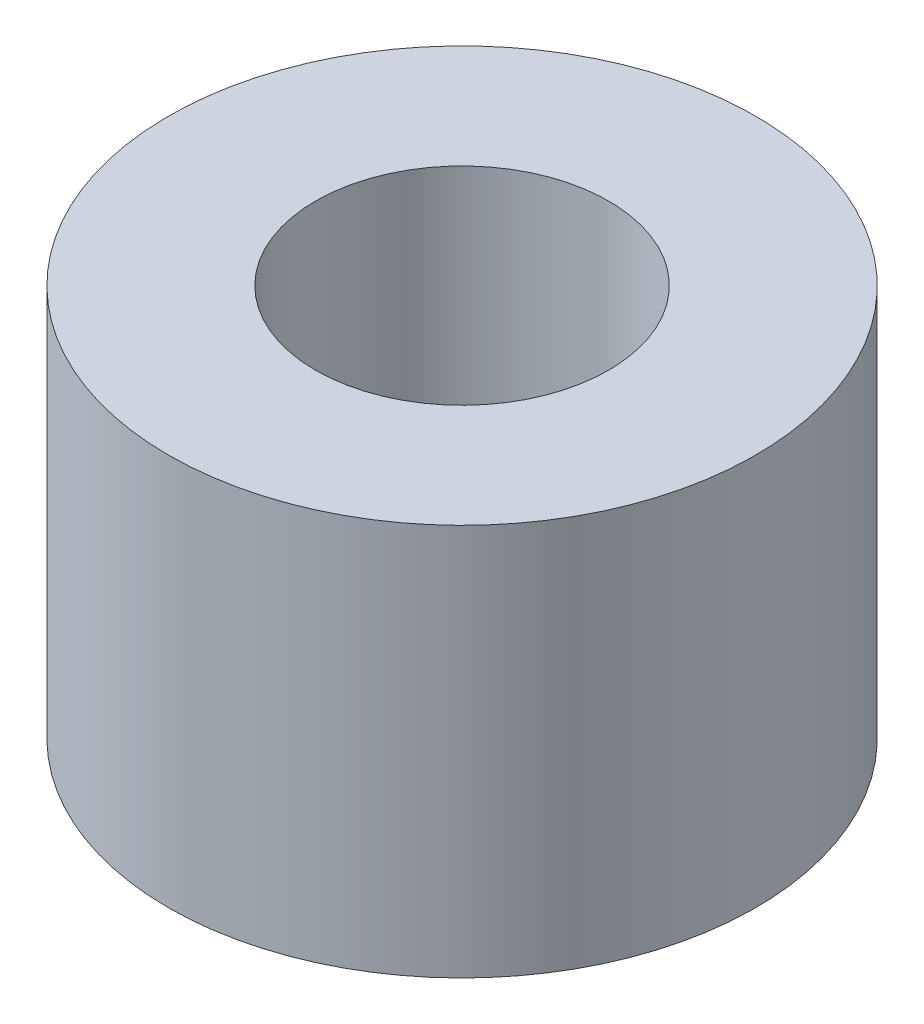
ISO-10303-21;
HEADER;
FILE_DESCRIPTION(('STEP AP214'),'2;1');
FILE_NAME('part.step','',(''),(''),'','','');
FILE_SCHEMA(('AUTOMOTIVE_DESIGN { 1 0 10303 214 1 1 1 1 }'));
ENDSEC;
DATA;
#1=APPLICATION_CONTEXT('core data for automotive mechanical design processes');
#2=APPLICATION_PROTOCOL_DEFINITION('international standard','automotive_design',2000,#1);
#3=PRODUCT_CONTEXT('',#1,'mechanical');
#4=PRODUCT('Part','Part','',(#3));
#5=PRODUCT_RELATED_PRODUCT_CATEGORY('part','',(#4));
#6=PRODUCT_DEFINITION_FORMATION('','',#4);
#7=PRODUCT_DEFINITION_CONTEXT('part definition',#1,'design');
#8=PRODUCT_DEFINITION('design','',#6,#7);
#9=PRODUCT_DEFINITION_SHAPE('','',#8);
#10=(LENGTH_UNIT() NAMED_UNIT(*) SI_UNIT(.MILLI.,.METRE.));
#11=(NAMED_UNIT(*) PLANE_ANGLE_UNIT() SI_UNIT($,.RADIAN.));
#12=(NAMED_UNIT(*) SI_UNIT($,.STERADIAN.) SOLID_ANGLE_UNIT());
#13=UNCERTAINTY_MEASURE_WITH_UNIT(LENGTH_MEASURE(1.E-05),#10,'distance_accuracy_value','');
#14=(GEOMETRIC_REPRESENTATION_CONTEXT(3) GLOBAL_UNCERTAINTY_ASSIGNED_CONTEXT((#13)) GLOBAL_UNIT_ASSIGNED_CONTEXT((#10,
#11,#12)) REPRESENTATION_CONTEXT('',''));
#15=CARTESIAN_POINT('',(0.,0.,0.));
#16=DIRECTION('',(0.,0.,1.));
#17=DIRECTION('',(1.,0.,0.));
#18=AXIS2_PLACEMENT_3D('',#15,#16,#17);
#19=CARTESIAN_POINT('',(0.,4.,-0.123865495102668));
#20=DIRECTION('',(0.,1.,0.));
#21=DIRECTION('',(0.,0.,1.));
#22=AXIS2_PLACEMENT_3D('',#19,#20,#21);
#23=PLANE('',#22);
#24=CARTESIAN_POINT('',(0.,4.,-0.123865495102668));
#25=DIRECTION('',(0.,1.,0.));
#26=DIRECTION('',(0.,0.,1.));
#27=AXIS2_PLACEMENT_3D('',#24,#25,#26);
#28=CIRCLE('',#27,2.99560024015319);
#29=CARTESIAN_POINT('',(0.,4.,2.87173474505052));
#30=VERTEX_POINT('',#29);
#31=EDGE_CURVE('E10',#30,#30,#28,.T.);
#32=ORIENTED_EDGE('',*,*,#31,.T.);
#33=EDGE_LOOP('',(#32));
#34=FACE_BOUND('',#33,.T.);
#35=CARTESIAN_POINT('',(1.3233859494366E-07,4.,-0.123865454773368));
#36=DIRECTION('',(0.,1.,0.));
#37=DIRECTION('',(0.,0.,1.));
#38=AXIS2_PLACEMENT_3D('',#35,#36,#37);
#39=CIRCLE('',#38,1.49559869538042);
#40=CARTESIAN_POINT('',(1.3233859494366E-07,4.,1.37173324060705));
#41=VERTEX_POINT('',#40);
#42=EDGE_CURVE('E50',#41,#41,#39,.T.);
#43=ORIENTED_EDGE('',*,*,#42,.F.);
#44=EDGE_LOOP('',(#43));
#45=FACE_BOUND('',#44,.T.);
#46=ADVANCED_FACE('F37',(#34,#45),#23,.T.);
#47=CARTESIAN_POINT('',(0.,0.,-0.123865495102668));
#48=DIRECTION('',(0.,1.,0.));
#49=DIRECTION('',(0.,0.,1.));
#50=AXIS2_PLACEMENT_3D('',#47,#48,#49);
#51=PLANE('',#50);
#52=CARTESIAN_POINT('',(0.,0.,-0.123865495102668));
#53=DIRECTION('',(0.,1.,0.));
#54=DIRECTION('',(0.,0.,1.));
#55=AXIS2_PLACEMENT_3D('',#52,#53,#54);
#56=CIRCLE('',#55,2.99560024015319);
#57=CARTESIAN_POINT('',(0.,0.,2.87173474505052));
#58=VERTEX_POINT('',#57);
#59=EDGE_CURVE('E41',#58,#58,#56,.T.);
#60=ORIENTED_EDGE('',*,*,#59,.F.);
#61=EDGE_LOOP('',(#60));
#62=FACE_BOUND('',#61,.T.);
#63=CARTESIAN_POINT('',(1.3233859494366E-07,0.,-0.123865454773368));
#64=DIRECTION('',(0.,1.,0.));
#65=DIRECTION('',(0.,0.,1.));
#66=AXIS2_PLACEMENT_3D('',#63,#64,#65);
#67=CIRCLE('',#66,1.49559869538042);
#68=CARTESIAN_POINT('',(1.3233859494366E-07,0.,1.37173324060705));
#69=VERTEX_POINT('',#68);
#70=EDGE_CURVE('E52',#69,#69,#67,.T.);
#71=ORIENTED_EDGE('',*,*,#70,.T.);
#72=EDGE_LOOP('',(#71));
#73=FACE_BOUND('',#72,.T.);
#74=ADVANCED_FACE('F64',(#62,#73),#51,.F.);
#75=CARTESIAN_POINT('',(0.,4.,-0.123865495102668));
#76=DIRECTION('',(0.,-1.,0.));
#77=DIRECTION('',(0.,0.,-1.));
#78=AXIS2_PLACEMENT_3D('',#75,#76,#77);
#79=CYLINDRICAL_SURFACE('',#78,2.99560024015319);
#80=ORIENTED_EDGE('',*,*,#31,.F.);
#81=EDGE_LOOP('',(#80));
#82=FACE_BOUND('',#81,.T.);
#83=ORIENTED_EDGE('',*,*,#59,.T.);
#84=EDGE_LOOP('',(#83));
#85=FACE_BOUND('',#84,.T.);
#86=ADVANCED_FACE('F39',(#82,#85),#79,.T.);
#87=CARTESIAN_POINT('',(1.3233859494366E-07,4.,-0.123865454773368));
#88=DIRECTION('',(0.,-1.,0.));
#89=DIRECTION('',(0.,0.,-1.));
#90=AXIS2_PLACEMENT_3D('',#87,#88,#89);
#91=CYLINDRICAL_SURFACE('',#90,1.49559869538042);
#92=ORIENTED_EDGE('',*,*,#42,.T.);
#93=EDGE_LOOP('',(#92));
#94=FACE_BOUND('',#93,.T.);
#95=ORIENTED_EDGE('',*,*,#70,.F.);
#96=EDGE_LOOP('',(#95));
#97=FACE_BOUND('',#96,.T.);
#98=ADVANCED_FACE('F60',(#94,#97),#91,.F.);
#99=CLOSED_SHELL('',(#46,#74,#86,#98));
#100=MANIFOLD_SOLID_BREP('B2',#99);
#101=ADVANCED_BREP_SHAPE_REPRESENTATION('',(#18,#100),#14);
#102=SHAPE_DEFINITION_REPRESENTATION(#9,#101);
ENDSEC;
END-ISO-10303-21;
